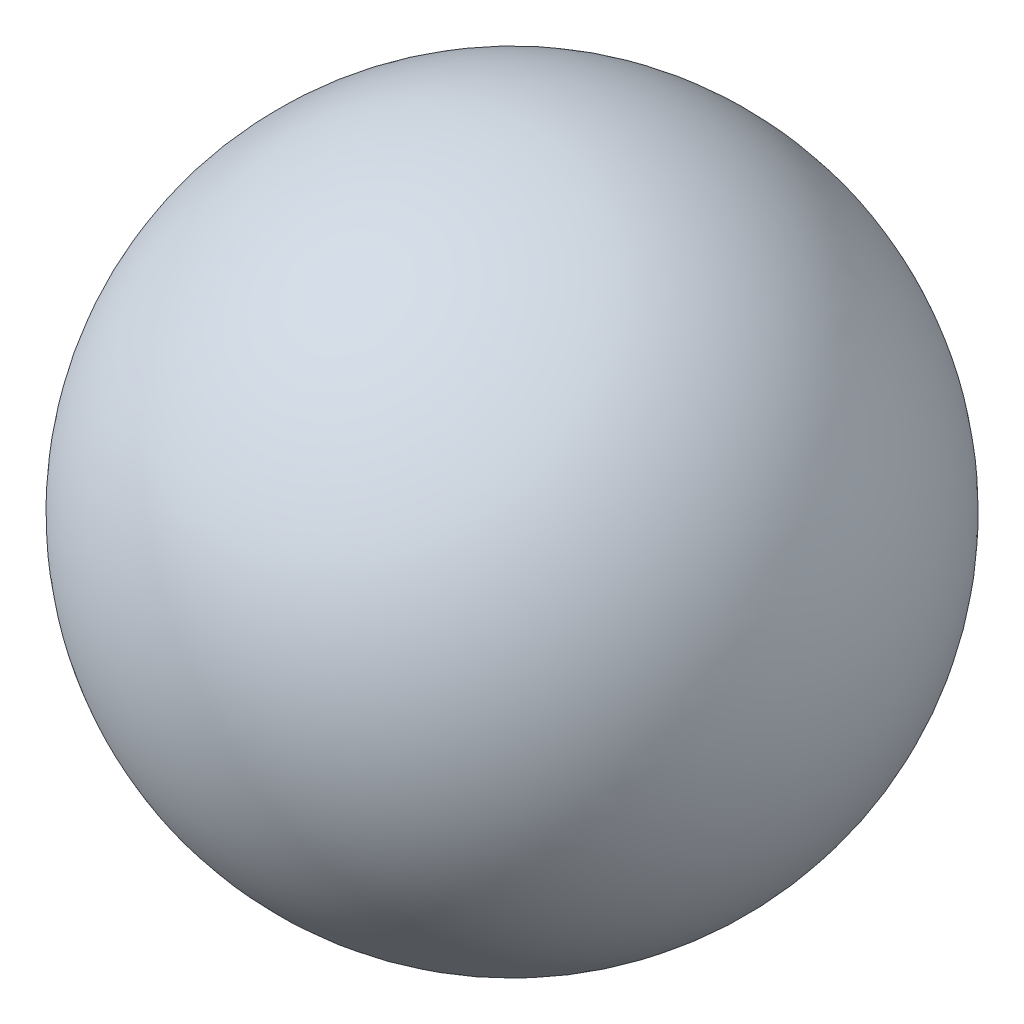
ISO-10303-21;
HEADER;
FILE_DESCRIPTION(('STEP AP214'),'2;1');
FILE_NAME('part.step','',(''),(''),'','','');
FILE_SCHEMA(('AUTOMOTIVE_DESIGN { 1 0 10303 214 1 1 1 1 }'));
ENDSEC;
DATA;
#1=APPLICATION_CONTEXT('core data for automotive mechanical design processes');
#2=APPLICATION_PROTOCOL_DEFINITION('international standard','automotive_design',2000,#1);
#3=PRODUCT_CONTEXT('',#1,'mechanical');
#4=PRODUCT('Part','Part','',(#3));
#5=PRODUCT_RELATED_PRODUCT_CATEGORY('part','',(#4));
#6=PRODUCT_DEFINITION_FORMATION('','',#4);
#7=PRODUCT_DEFINITION_CONTEXT('part definition',#1,'design');
#8=PRODUCT_DEFINITION('design','',#6,#7);
#9=PRODUCT_DEFINITION_SHAPE('','',#8);
#10=(LENGTH_UNIT() NAMED_UNIT(*) SI_UNIT(.MILLI.,.METRE.));
#11=(NAMED_UNIT(*) PLANE_ANGLE_UNIT() SI_UNIT($,.RADIAN.));
#12=(NAMED_UNIT(*) SI_UNIT($,.STERADIAN.) SOLID_ANGLE_UNIT());
#13=UNCERTAINTY_MEASURE_WITH_UNIT(LENGTH_MEASURE(1.E-05),#10,'distance_accuracy_value','');
#14=(GEOMETRIC_REPRESENTATION_CONTEXT(3) GLOBAL_UNCERTAINTY_ASSIGNED_CONTEXT((#13)) GLOBAL_UNIT_ASSIGNED_CONTEXT((#10,
#11,#12)) REPRESENTATION_CONTEXT('',''));
#15=CARTESIAN_POINT('',(0.,0.,0.));
#16=DIRECTION('',(0.,0.,1.));
#17=DIRECTION('',(1.,0.,0.));
#18=AXIS2_PLACEMENT_3D('',#15,#16,#17);
#19=CARTESIAN_POINT('',(0.,0.,-24.5));
#20=DIRECTION('',(0.,0.,1.));
#21=DIRECTION('',(-1.,0.,0.));
#22=AXIS2_PLACEMENT_3D('',#19,#20,#21);
#23=SPHERICAL_SURFACE('',#22,24.5);
#24=CARTESIAN_POINT('',(0.,0.,0.));
#25=VERTEX_POINT('',#24);
#26=VERTEX_LOOP('',#25);
#27=FACE_BOUND('',#26,.T.);
#28=ADVANCED_FACE('F30',(#27),#23,.T.);
#29=CLOSED_SHELL('',(#28));
#30=MANIFOLD_SOLID_BREP('B2',#29);
#31=ADVANCED_BREP_SHAPE_REPRESENTATION('',(#18,#30),#14);
#32=SHAPE_DEFINITION_REPRESENTATION(#9,#31);
ENDSEC;
END-ISO-10303-21;
